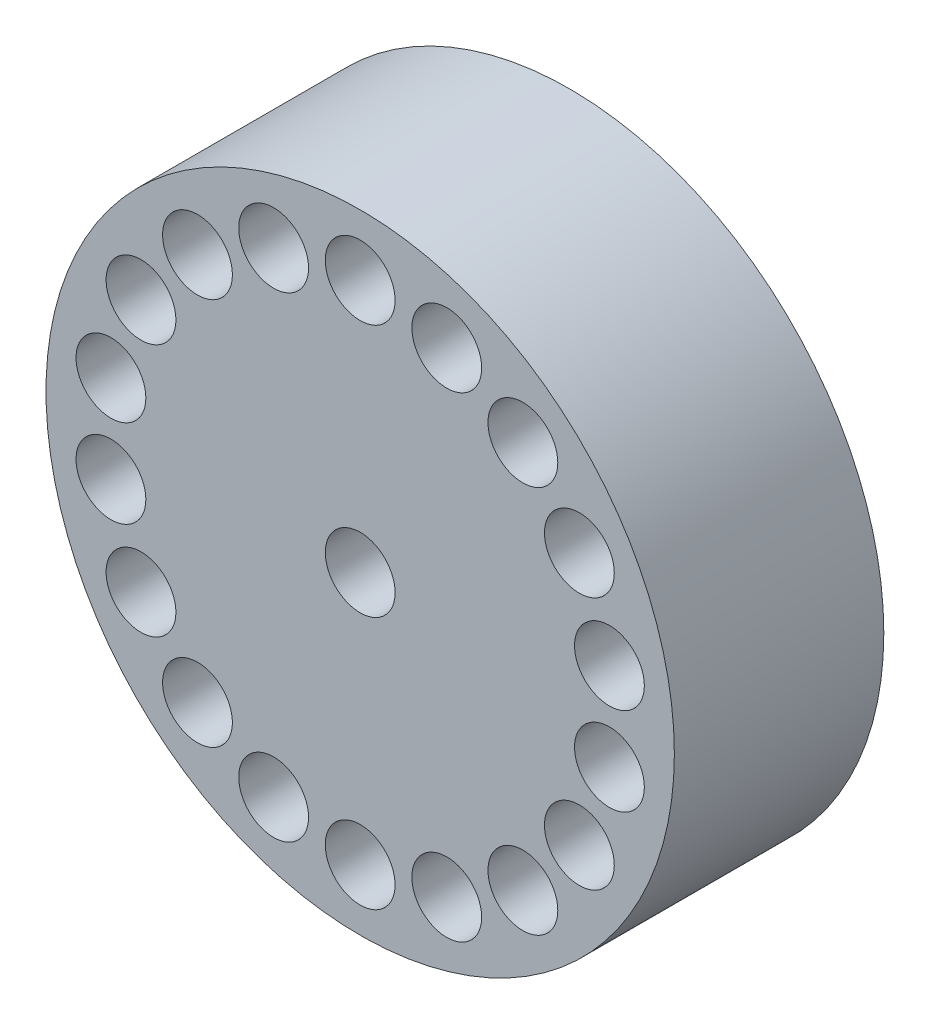
ISO-10303-21;
HEADER;
FILE_DESCRIPTION(('STEP AP214'),'2;1');
FILE_NAME('part.step','',(''),(''),'','','');
FILE_SCHEMA(('AUTOMOTIVE_DESIGN { 1 0 10303 214 1 1 1 1 }'));
ENDSEC;
DATA;
#1=APPLICATION_CONTEXT('core data for automotive mechanical design processes');
#2=APPLICATION_PROTOCOL_DEFINITION('international standard','automotive_design',2000,#1);
#3=PRODUCT_CONTEXT('',#1,'mechanical');
#4=PRODUCT('Part','Part','',(#3));
#5=PRODUCT_RELATED_PRODUCT_CATEGORY('part','',(#4));
#6=PRODUCT_DEFINITION_FORMATION('','',#4);
#7=PRODUCT_DEFINITION_CONTEXT('part definition',#1,'design');
#8=PRODUCT_DEFINITION('design','',#6,#7);
#9=PRODUCT_DEFINITION_SHAPE('','',#8);
#10=(LENGTH_UNIT() NAMED_UNIT(*) SI_UNIT(.MILLI.,.METRE.));
#11=(NAMED_UNIT(*) PLANE_ANGLE_UNIT() SI_UNIT($,.RADIAN.));
#12=(NAMED_UNIT(*) SI_UNIT($,.STERADIAN.) SOLID_ANGLE_UNIT());
#13=UNCERTAINTY_MEASURE_WITH_UNIT(LENGTH_MEASURE(1.E-05),#10,'distance_accuracy_value','');
#14=(GEOMETRIC_REPRESENTATION_CONTEXT(3) GLOBAL_UNCERTAINTY_ASSIGNED_CONTEXT((#13)) GLOBAL_UNIT_ASSIGNED_CONTEXT((#10,
#11,#12)) REPRESENTATION_CONTEXT('',''));
#15=CARTESIAN_POINT('',(0.,0.,0.));
#16=DIRECTION('',(0.,0.,1.));
#17=DIRECTION('',(1.,0.,0.));
#18=AXIS2_PLACEMENT_3D('',#15,#16,#17);
#19=CARTESIAN_POINT('',(0.,0.,3.));
#20=DIRECTION('',(0.,0.,1.));
#21=DIRECTION('',(1.,0.,0.));
#22=AXIS2_PLACEMENT_3D('',#19,#20,#21);
#23=PLANE('',#22);
#24=CARTESIAN_POINT('',(3.56992810466938,0.629474644042774,3.));
#25=DIRECTION('',(0.,0.,1.));
#26=DIRECTION('',(1.,0.,0.));
#27=AXIS2_PLACEMENT_3D('',#24,#25,#26);
#28=CIRCLE('',#27,0.500000000000088);
#29=CARTESIAN_POINT('',(4.06992810466947,0.629474644042774,3.));
#30=VERTEX_POINT('',#29);
#31=EDGE_CURVE('E119',#30,#30,#28,.T.);
#32=ORIENTED_EDGE('',*,*,#31,.F.);
#33=EDGE_LOOP('',(#32));
#34=FACE_BOUND('',#33,.T.);
#35=CARTESIAN_POINT('',(3.13934208871867,1.81250000000013,3.));
#36=DIRECTION('',(0.,0.,1.));
#37=DIRECTION('',(1.,0.,0.));
#38=AXIS2_PLACEMENT_3D('',#35,#36,#37);
#39=CIRCLE('',#38,0.500000000000043);
#40=CARTESIAN_POINT('',(3.63934208871871,1.81250000000013,3.));
#41=VERTEX_POINT('',#40);
#42=EDGE_CURVE('E147',#41,#41,#39,.T.);
#43=ORIENTED_EDGE('',*,*,#42,.F.);
#44=EDGE_LOOP('',(#43));
#45=FACE_BOUND('',#44,.T.);
#46=CARTESIAN_POINT('',(2.33010508511374,2.77691110630639,3.));
#47=DIRECTION('',(0.,0.,1.));
#48=DIRECTION('',(1.,0.,0.));
#49=AXIS2_PLACEMENT_3D('',#46,#47,#48);
#50=CIRCLE('',#49,0.500000000000011);
#51=CARTESIAN_POINT('',(2.83010508511375,2.77691110630639,3.));
#52=VERTEX_POINT('',#51);
#53=EDGE_CURVE('E130',#52,#52,#50,.T.);
#54=ORIENTED_EDGE('',*,*,#53,.F.);
#55=EDGE_LOOP('',(#54));
#56=FACE_BOUND('',#55,.T.);
#57=CARTESIAN_POINT('',(1.23982301955555,3.40638575034892,3.));
#58=DIRECTION('',(0.,0.,1.));
#59=DIRECTION('',(1.,0.,0.));
#60=AXIS2_PLACEMENT_3D('',#57,#58,#59);
#61=CIRCLE('',#60,0.5);
#62=CARTESIAN_POINT('',(1.73982301955555,3.40638575034892,3.));
#63=VERTEX_POINT('',#62);
#64=EDGE_CURVE('E137',#63,#63,#61,.T.);
#65=ORIENTED_EDGE('',*,*,#64,.F.);
#66=EDGE_LOOP('',(#65));
#67=FACE_BOUND('',#66,.T.);
#68=CARTESIAN_POINT('',(1.23982301955585,-3.40638575034887,3.));
#69=DIRECTION('',(0.,0.,1.));
#70=DIRECTION('',(1.,0.,0.));
#71=AXIS2_PLACEMENT_3D('',#68,#69,#70);
#72=CIRCLE('',#71,0.500000000000292);
#73=CARTESIAN_POINT('',(1.73982301955614,-3.40638575034887,3.));
#74=VERTEX_POINT('',#73);
#75=EDGE_CURVE('E105',#74,#74,#72,.T.);
#76=ORIENTED_EDGE('',*,*,#75,.F.);
#77=EDGE_LOOP('',(#76));
#78=FACE_BOUND('',#77,.T.);
#79=CARTESIAN_POINT('',(2.33010508511398,-2.7769111063062,3.));
#80=DIRECTION('',(0.,0.,1.));
#81=DIRECTION('',(1.,0.,0.));
#82=AXIS2_PLACEMENT_3D('',#79,#80,#81);
#83=CIRCLE('',#82,0.50000000000025);
#84=CARTESIAN_POINT('',(2.83010508511423,-2.7769111063062,3.));
#85=VERTEX_POINT('',#84);
#86=EDGE_CURVE('E125',#85,#85,#83,.T.);
#87=ORIENTED_EDGE('',*,*,#86,.F.);
#88=EDGE_LOOP('',(#87));
#89=FACE_BOUND('',#88,.T.);
#90=CARTESIAN_POINT('',(3.13934208871882,-1.81249999999987,3.));
#91=DIRECTION('',(0.,0.,1.));
#92=DIRECTION('',(1.,0.,0.));
#93=AXIS2_PLACEMENT_3D('',#90,#91,#92);
#94=CIRCLE('',#93,0.500000000000199);
#95=CARTESIAN_POINT('',(3.63934208871902,-1.81249999999987,3.));
#96=VERTEX_POINT('',#95);
#97=EDGE_CURVE('E106',#96,#96,#94,.T.);
#98=ORIENTED_EDGE('',*,*,#97,.F.);
#99=EDGE_LOOP('',(#98));
#100=FACE_BOUND('',#99,.T.);
#101=CARTESIAN_POINT('',(3.56992810466943,-0.629474644042471,3.));
#102=DIRECTION('',(0.,0.,1.));
#103=DIRECTION('',(1.,0.,0.));
#104=AXIS2_PLACEMENT_3D('',#101,#102,#103);
#105=CIRCLE('',#104,0.500000000000141);
#106=CARTESIAN_POINT('',(4.06992810466958,-0.629474644042471,3.));
#107=VERTEX_POINT('',#106);
#108=EDGE_CURVE('E113',#107,#107,#105,.T.);
#109=ORIENTED_EDGE('',*,*,#108,.F.);
#110=EDGE_LOOP('',(#109));
#111=FACE_BOUND('',#110,.T.);
#112=CARTESIAN_POINT('',(3.07754286661571E-13,-3.625,3.));
#113=DIRECTION('',(0.,0.,1.));
#114=DIRECTION('',(1.,0.,0.));
#115=AXIS2_PLACEMENT_3D('',#112,#113,#114);
#116=CIRCLE('',#115,0.500000000000319);
#117=CARTESIAN_POINT('',(0.500000000000626,-3.625,3.));
#118=VERTEX_POINT('',#117);
#119=EDGE_CURVE('E99',#118,#118,#116,.T.);
#120=ORIENTED_EDGE('',*,*,#119,.F.);
#121=EDGE_LOOP('',(#120));
#122=FACE_BOUND('',#121,.T.);
#123=CARTESIAN_POINT('',(-1.23982301955525,-3.40638575034897,3.));
#124=DIRECTION('',(0.,0.,1.));
#125=DIRECTION('',(1.,0.,0.));
#126=AXIS2_PLACEMENT_3D('',#123,#124,#125);
#127=CIRCLE('',#126,0.500000000000326);
#128=CARTESIAN_POINT('',(-0.739823019554925,-3.40638575034897,3.));
#129=VERTEX_POINT('',#128);
#130=EDGE_CURVE('E89',#129,#129,#127,.T.);
#131=ORIENTED_EDGE('',*,*,#130,.F.);
#132=EDGE_LOOP('',(#131));
#133=FACE_BOUND('',#132,.T.);
#134=CARTESIAN_POINT('',(-3.13934208871836,-1.81250000000013,3.));
#135=DIRECTION('',(0.,0.,1.));
#136=DIRECTION('',(1.,0.,0.));
#137=AXIS2_PLACEMENT_3D('',#134,#135,#136);
#138=CIRCLE('',#137,0.500000000000293);
#139=CARTESIAN_POINT('',(-2.63934208871807,-1.81250000000013,3.));
#140=VERTEX_POINT('',#139);
#141=EDGE_CURVE('E81',#140,#140,#138,.T.);
#142=ORIENTED_EDGE('',*,*,#141,.F.);
#143=EDGE_LOOP('',(#142));
#144=FACE_BOUND('',#143,.T.);
#145=CARTESIAN_POINT('',(-2.33010508511343,-2.77691110630639,3.));
#146=DIRECTION('',(0.,0.,1.));
#147=DIRECTION('',(1.,0.,0.));
#148=AXIS2_PLACEMENT_3D('',#145,#146,#147);
#149=CIRCLE('',#148,0.500000000000317);
#150=CARTESIAN_POINT('',(-1.83010508511312,-2.77691110630639,3.));
#151=VERTEX_POINT('',#150);
#152=EDGE_CURVE('E82',#151,#151,#149,.T.);
#153=ORIENTED_EDGE('',*,*,#152,.F.);
#154=EDGE_LOOP('',(#153));
#155=FACE_BOUND('',#154,.T.);
#156=CARTESIAN_POINT('',(-3.56992810466907,-0.629474644042774,3.));
#157=DIRECTION('',(0.,0.,1.));
#158=DIRECTION('',(1.,0.,0.));
#159=AXIS2_PLACEMENT_3D('',#156,#157,#158);
#160=CIRCLE('',#159,0.500000000000251);
#161=CARTESIAN_POINT('',(-3.06992810466882,-0.629474644042774,3.));
#162=VERTEX_POINT('',#161);
#163=EDGE_CURVE('E75',#162,#162,#160,.T.);
#164=ORIENTED_EDGE('',*,*,#163,.F.);
#165=EDGE_LOOP('',(#164));
#166=FACE_BOUND('',#165,.T.);
#167=CARTESIAN_POINT('',(-3.56992810466913,0.62947464404247,3.));
#168=DIRECTION('',(0.,0.,1.));
#169=DIRECTION('',(1.,0.,0.));
#170=AXIS2_PLACEMENT_3D('',#167,#168,#169);
#171=CIRCLE('',#170,0.500000000000202);
#172=CARTESIAN_POINT('',(-3.06992810466893,0.62947464404247,3.));
#173=VERTEX_POINT('',#172);
#174=EDGE_CURVE('E63',#173,#173,#171,.T.);
#175=ORIENTED_EDGE('',*,*,#174,.F.);
#176=EDGE_LOOP('',(#175));
#177=FACE_BOUND('',#176,.T.);
#178=CARTESIAN_POINT('',(-2.33010508511367,2.7769111063062,3.));
#179=DIRECTION('',(0.,0.,1.));
#180=DIRECTION('',(1.,0.,0.));
#181=AXIS2_PLACEMENT_3D('',#178,#179,#180);
#182=CIRCLE('',#181,0.500000000000108);
#183=CARTESIAN_POINT('',(-1.83010508511356,2.7769111063062,3.));
#184=VERTEX_POINT('',#183);
#185=EDGE_CURVE('E64',#184,#184,#182,.T.);
#186=ORIENTED_EDGE('',*,*,#185,.F.);
#187=EDGE_LOOP('',(#186));
#188=FACE_BOUND('',#187,.T.);
#189=CARTESIAN_POINT('',(-3.13934208871851,1.81249999999987,3.));
#190=DIRECTION('',(0.,0.,1.));
#191=DIRECTION('',(1.,0.,0.));
#192=AXIS2_PLACEMENT_3D('',#189,#190,#191);
#193=CIRCLE('',#192,0.500000000000153);
#194=CARTESIAN_POINT('',(-2.63934208871836,1.81249999999987,3.));
#195=VERTEX_POINT('',#194);
#196=EDGE_CURVE('E56',#195,#195,#193,.T.);
#197=ORIENTED_EDGE('',*,*,#196,.F.);
#198=EDGE_LOOP('',(#197));
#199=FACE_BOUND('',#198,.T.);
#200=CARTESIAN_POINT('',(-1.23982301955551,3.40638575034893,3.));
#201=DIRECTION('',(0.,0.,1.));
#202=DIRECTION('',(1.,0.,0.));
#203=AXIS2_PLACEMENT_3D('',#200,#201,#202);
#204=CIRCLE('',#203,0.5);
#205=CARTESIAN_POINT('',(-0.739823019555507,3.40638575034893,3.));
#206=VERTEX_POINT('',#205);
#207=EDGE_CURVE('E152',#206,#206,#204,.T.);
#208=ORIENTED_EDGE('',*,*,#207,.F.);
#209=EDGE_LOOP('',(#208));
#210=FACE_BOUND('',#209,.T.);
#211=CARTESIAN_POINT('',(0.,3.625,3.));
#212=DIRECTION('',(0.,0.,1.));
#213=DIRECTION('',(1.,0.,0.));
#214=AXIS2_PLACEMENT_3D('',#211,#212,#213);
#215=CIRCLE('',#214,0.5);
#216=CARTESIAN_POINT('',(0.5,3.625,3.));
#217=VERTEX_POINT('',#216);
#218=EDGE_CURVE('E50',#217,#217,#215,.T.);
#219=ORIENTED_EDGE('',*,*,#218,.F.);
#220=EDGE_LOOP('',(#219));
#221=FACE_BOUND('',#220,.T.);
#222=CARTESIAN_POINT('',(0.,0.,3.));
#223=DIRECTION('',(0.,0.,1.));
#224=DIRECTION('',(1.,0.,0.));
#225=AXIS2_PLACEMENT_3D('',#222,#223,#224);
#226=CIRCLE('',#225,4.5);
#227=CARTESIAN_POINT('',(4.5,0.,3.));
#228=VERTEX_POINT('',#227);
#229=EDGE_CURVE('E10',#228,#228,#226,.T.);
#230=ORIENTED_EDGE('',*,*,#229,.T.);
#231=EDGE_LOOP('',(#230));
#232=FACE_BOUND('',#231,.T.);
#233=CARTESIAN_POINT('',(0.,0.,3.));
#234=DIRECTION('',(0.,0.,1.));
#235=DIRECTION('',(1.,0.,0.));
#236=AXIS2_PLACEMENT_3D('',#233,#234,#235);
#237=CIRCLE('',#236,0.5);
#238=CARTESIAN_POINT('',(0.5,0.,3.));
#239=VERTEX_POINT('',#238);
#240=EDGE_CURVE('E42',#239,#239,#237,.T.);
#241=ORIENTED_EDGE('',*,*,#240,.F.);
#242=EDGE_LOOP('',(#241));
#243=FACE_BOUND('',#242,.T.);
#244=ADVANCED_FACE('F31',(#34,#45,#56,#67,#78,#89,#100,#111,#122,#133,#144,#155,#166,#177,#188,
#199,#210,#221,#232,#243),#23,.T.);
#245=CARTESIAN_POINT('',(0.,0.,0.));
#246=DIRECTION('',(0.,0.,1.));
#247=DIRECTION('',(1.,0.,0.));
#248=AXIS2_PLACEMENT_3D('',#245,#246,#247);
#249=PLANE('',#248);
#250=CARTESIAN_POINT('',(0.,0.,0.));
#251=DIRECTION('',(0.,0.,1.));
#252=DIRECTION('',(1.,0.,0.));
#253=AXIS2_PLACEMENT_3D('',#250,#251,#252);
#254=CIRCLE('',#253,4.5);
#255=CARTESIAN_POINT('',(4.5,0.,0.));
#256=VERTEX_POINT('',#255);
#257=EDGE_CURVE('E35',#256,#256,#254,.T.);
#258=ORIENTED_EDGE('',*,*,#257,.F.);
#259=EDGE_LOOP('',(#258));
#260=FACE_BOUND('',#259,.T.);
#261=CARTESIAN_POINT('',(0.,0.,0.));
#262=DIRECTION('',(0.,0.,1.));
#263=DIRECTION('',(1.,0.,0.));
#264=AXIS2_PLACEMENT_3D('',#261,#262,#263);
#265=CIRCLE('',#264,0.5);
#266=CARTESIAN_POINT('',(0.5,0.,0.));
#267=VERTEX_POINT('',#266);
#268=EDGE_CURVE('E44',#267,#267,#265,.T.);
#269=ORIENTED_EDGE('',*,*,#268,.T.);
#270=EDGE_LOOP('',(#269));
#271=FACE_BOUND('',#270,.T.);
#272=ADVANCED_FACE('F169',(#260,#271),#249,.F.);
#273=CARTESIAN_POINT('',(0.,0.,3.));
#274=DIRECTION('',(0.,0.,-1.));
#275=DIRECTION('',(-1.,0.,0.));
#276=AXIS2_PLACEMENT_3D('',#273,#274,#275);
#277=CYLINDRICAL_SURFACE('',#276,4.5);
#278=ORIENTED_EDGE('',*,*,#229,.F.);
#279=EDGE_LOOP('',(#278));
#280=FACE_BOUND('',#279,.T.);
#281=ORIENTED_EDGE('',*,*,#257,.T.);
#282=EDGE_LOOP('',(#281));
#283=FACE_BOUND('',#282,.T.);
#284=ADVANCED_FACE('F33',(#280,#283),#277,.T.);
#285=CARTESIAN_POINT('',(0.,0.,3.));
#286=DIRECTION('',(0.,0.,-1.));
#287=DIRECTION('',(-1.,0.,0.));
#288=AXIS2_PLACEMENT_3D('',#285,#286,#287);
#289=CYLINDRICAL_SURFACE('',#288,0.5);
#290=ORIENTED_EDGE('',*,*,#240,.T.);
#291=EDGE_LOOP('',(#290));
#292=FACE_BOUND('',#291,.T.);
#293=ORIENTED_EDGE('',*,*,#268,.F.);
#294=EDGE_LOOP('',(#293));
#295=FACE_BOUND('',#294,.T.);
#296=ADVANCED_FACE('F176',(#292,#295),#289,.F.);
#297=CARTESIAN_POINT('',(0.,3.625,2.));
#298=DIRECTION('',(0.,0.,1.));
#299=DIRECTION('',(1.,0.,0.));
#300=AXIS2_PLACEMENT_3D('',#297,#298,#299);
#301=CYLINDRICAL_SURFACE('',#300,0.5);
#302=CARTESIAN_POINT('',(0.,3.625,2.));
#303=DIRECTION('',(0.,0.,1.));
#304=DIRECTION('',(1.,0.,0.));
#305=AXIS2_PLACEMENT_3D('',#302,#303,#304);
#306=CIRCLE('',#305,0.5);
#307=CARTESIAN_POINT('',(0.5,3.625,2.));
#308=VERTEX_POINT('',#307);
#309=EDGE_CURVE('E47',#308,#308,#306,.T.);
#310=ORIENTED_EDGE('',*,*,#309,.F.);
#311=EDGE_LOOP('',(#310));
#312=FACE_BOUND('',#311,.T.);
#313=ORIENTED_EDGE('',*,*,#218,.T.);
#314=EDGE_LOOP('',(#313));
#315=FACE_BOUND('',#314,.T.);
#316=ADVANCED_FACE('F179',(#312,#315),#301,.F.);
#317=CARTESIAN_POINT('',(0.,3.625,2.));
#318=DIRECTION('',(0.,0.,1.));
#319=DIRECTION('',(1.,0.,0.));
#320=AXIS2_PLACEMENT_3D('',#317,#318,#319);
#321=PLANE('',#320);
#322=ORIENTED_EDGE('',*,*,#309,.T.);
#323=EDGE_LOOP('',(#322));
#324=FACE_BOUND('',#323,.T.);
#325=ADVANCED_FACE('F163',(#324),#321,.T.);
#326=CARTESIAN_POINT('',(-1.23982301955551,3.40638575034893,2.));
#327=DIRECTION('',(0.,0.,1.));
#328=DIRECTION('',(1.,0.,0.));
#329=AXIS2_PLACEMENT_3D('',#326,#327,#328);
#330=CYLINDRICAL_SURFACE('',#329,0.5);
#331=CARTESIAN_POINT('',(-1.23982301955551,3.40638575034893,2.));
#332=DIRECTION('',(0.,0.,1.));
#333=DIRECTION('',(1.,0.,0.));
#334=AXIS2_PLACEMENT_3D('',#331,#332,#333);
#335=CIRCLE('',#334,0.5);
#336=CARTESIAN_POINT('',(-0.739823019555507,3.40638575034893,2.));
#337=VERTEX_POINT('',#336);
#338=EDGE_CURVE('E67',#337,#337,#335,.T.);
#339=ORIENTED_EDGE('',*,*,#338,.F.);
#340=EDGE_LOOP('',(#339));
#341=FACE_BOUND('',#340,.T.);
#342=ORIENTED_EDGE('',*,*,#207,.T.);
#343=EDGE_LOOP('',(#342));
#344=FACE_BOUND('',#343,.T.);
#345=ADVANCED_FACE('F160',(#341,#344),#330,.F.);
#346=CARTESIAN_POINT('',(-1.23982301955551,3.40638575034893,2.));
#347=DIRECTION('',(0.,0.,1.));
#348=DIRECTION('',(1.,0.,0.));
#349=AXIS2_PLACEMENT_3D('',#346,#347,#348);
#350=PLANE('',#349);
#351=ORIENTED_EDGE('',*,*,#338,.T.);
#352=EDGE_LOOP('',(#351));
#353=FACE_BOUND('',#352,.T.);
#354=ADVANCED_FACE('F158',(#353),#350,.T.);
#355=CARTESIAN_POINT('',(-3.13934208871851,1.81249999999987,2.));
#356=DIRECTION('',(0.,0.,1.));
#357=DIRECTION('',(1.,0.,0.));
#358=AXIS2_PLACEMENT_3D('',#355,#356,#357);
#359=CYLINDRICAL_SURFACE('',#358,0.500000000000153);
#360=CARTESIAN_POINT('',(-3.13934208871851,1.81249999999987,2.));
#361=DIRECTION('',(0.,0.,1.));
#362=DIRECTION('',(1.,0.,0.));
#363=AXIS2_PLACEMENT_3D('',#360,#361,#362);
#364=CIRCLE('',#363,0.500000000000153);
#365=CARTESIAN_POINT('',(-2.63934208871836,1.81249999999987,2.));
#366=VERTEX_POINT('',#365);
#367=EDGE_CURVE('E59',#366,#366,#364,.T.);
#368=ORIENTED_EDGE('',*,*,#367,.F.);
#369=EDGE_LOOP('',(#368));
#370=FACE_BOUND('',#369,.T.);
#371=ORIENTED_EDGE('',*,*,#196,.T.);
#372=EDGE_LOOP('',(#371));
#373=FACE_BOUND('',#372,.T.);
#374=ADVANCED_FACE('F197',(#370,#373),#359,.F.);
#375=CARTESIAN_POINT('',(-3.13934208871851,1.81249999999987,2.));
#376=DIRECTION('',(0.,0.,1.));
#377=DIRECTION('',(1.,0.,0.));
#378=AXIS2_PLACEMENT_3D('',#375,#376,#377);
#379=PLANE('',#378);
#380=ORIENTED_EDGE('',*,*,#367,.T.);
#381=EDGE_LOOP('',(#380));
#382=FACE_BOUND('',#381,.T.);
#383=ADVANCED_FACE('F200',(#382),#379,.T.);
#384=CARTESIAN_POINT('',(-2.33010508511367,2.7769111063062,2.));
#385=DIRECTION('',(0.,0.,1.));
#386=DIRECTION('',(1.,0.,0.));
#387=AXIS2_PLACEMENT_3D('',#384,#385,#386);
#388=CYLINDRICAL_SURFACE('',#387,0.500000000000108);
#389=CARTESIAN_POINT('',(-2.33010508511367,2.7769111063062,2.));
#390=DIRECTION('',(0.,0.,1.));
#391=DIRECTION('',(1.,0.,0.));
#392=AXIS2_PLACEMENT_3D('',#389,#390,#391);
#393=CIRCLE('',#392,0.500000000000108);
#394=CARTESIAN_POINT('',(-1.83010508511356,2.7769111063062,2.));
#395=VERTEX_POINT('',#394);
#396=EDGE_CURVE('E60',#395,#395,#393,.T.);
#397=ORIENTED_EDGE('',*,*,#396,.F.);
#398=EDGE_LOOP('',(#397));
#399=FACE_BOUND('',#398,.T.);
#400=ORIENTED_EDGE('',*,*,#185,.T.);
#401=EDGE_LOOP('',(#400));
#402=FACE_BOUND('',#401,.T.);
#403=ADVANCED_FACE('F204',(#399,#402),#388,.F.);
#404=CARTESIAN_POINT('',(-2.33010508511367,2.7769111063062,2.));
#405=DIRECTION('',(0.,0.,1.));
#406=DIRECTION('',(1.,0.,0.));
#407=AXIS2_PLACEMENT_3D('',#404,#405,#406);
#408=PLANE('',#407);
#409=ORIENTED_EDGE('',*,*,#396,.T.);
#410=EDGE_LOOP('',(#409));
#411=FACE_BOUND('',#410,.T.);
#412=ADVANCED_FACE('F208',(#411),#408,.T.);
#413=CARTESIAN_POINT('',(-3.56992810466913,0.62947464404247,2.));
#414=DIRECTION('',(0.,0.,1.));
#415=DIRECTION('',(1.,0.,0.));
#416=AXIS2_PLACEMENT_3D('',#413,#414,#415);
#417=CYLINDRICAL_SURFACE('',#416,0.500000000000202);
#418=CARTESIAN_POINT('',(-3.56992810466913,0.62947464404247,2.));
#419=DIRECTION('',(0.,0.,1.));
#420=DIRECTION('',(1.,0.,0.));
#421=AXIS2_PLACEMENT_3D('',#418,#419,#420);
#422=CIRCLE('',#421,0.500000000000202);
#423=CARTESIAN_POINT('',(-3.06992810466893,0.62947464404247,2.));
#424=VERTEX_POINT('',#423);
#425=EDGE_CURVE('E72',#424,#424,#422,.T.);
#426=ORIENTED_EDGE('',*,*,#425,.F.);
#427=EDGE_LOOP('',(#426));
#428=FACE_BOUND('',#427,.T.);
#429=ORIENTED_EDGE('',*,*,#174,.T.);
#430=EDGE_LOOP('',(#429));
#431=FACE_BOUND('',#430,.T.);
#432=ADVANCED_FACE('F212',(#428,#431),#417,.F.);
#433=CARTESIAN_POINT('',(-3.56992810466913,0.62947464404247,2.));
#434=DIRECTION('',(0.,0.,1.));
#435=DIRECTION('',(1.,0.,0.));
#436=AXIS2_PLACEMENT_3D('',#433,#434,#435);
#437=PLANE('',#436);
#438=ORIENTED_EDGE('',*,*,#425,.T.);
#439=EDGE_LOOP('',(#438));
#440=FACE_BOUND('',#439,.T.);
#441=ADVANCED_FACE('F216',(#440),#437,.T.);
#442=CARTESIAN_POINT('',(-3.56992810466907,-0.629474644042774,2.));
#443=DIRECTION('',(0.,0.,1.));
#444=DIRECTION('',(1.,0.,0.));
#445=AXIS2_PLACEMENT_3D('',#442,#443,#444);
#446=CYLINDRICAL_SURFACE('',#445,0.500000000000251);
#447=CARTESIAN_POINT('',(-3.56992810466907,-0.629474644042774,2.));
#448=DIRECTION('',(0.,0.,1.));
#449=DIRECTION('',(1.,0.,0.));
#450=AXIS2_PLACEMENT_3D('',#447,#448,#449);
#451=CIRCLE('',#450,0.500000000000251);
#452=CARTESIAN_POINT('',(-3.06992810466882,-0.629474644042774,2.));
#453=VERTEX_POINT('',#452);
#454=EDGE_CURVE('E78',#453,#453,#451,.T.);
#455=ORIENTED_EDGE('',*,*,#454,.F.);
#456=EDGE_LOOP('',(#455));
#457=FACE_BOUND('',#456,.T.);
#458=ORIENTED_EDGE('',*,*,#163,.T.);
#459=EDGE_LOOP('',(#458));
#460=FACE_BOUND('',#459,.T.);
#461=ADVANCED_FACE('F220',(#457,#460),#446,.F.);
#462=CARTESIAN_POINT('',(-3.56992810466907,-0.629474644042774,2.));
#463=DIRECTION('',(0.,0.,1.));
#464=DIRECTION('',(1.,0.,0.));
#465=AXIS2_PLACEMENT_3D('',#462,#463,#464);
#466=PLANE('',#465);
#467=ORIENTED_EDGE('',*,*,#454,.T.);
#468=EDGE_LOOP('',(#467));
#469=FACE_BOUND('',#468,.T.);
#470=ADVANCED_FACE('F224',(#469),#466,.T.);
#471=CARTESIAN_POINT('',(-2.33010508511343,-2.77691110630639,2.));
#472=DIRECTION('',(0.,0.,1.));
#473=DIRECTION('',(1.,0.,0.));
#474=AXIS2_PLACEMENT_3D('',#471,#472,#473);
#475=CYLINDRICAL_SURFACE('',#474,0.500000000000317);
#476=CARTESIAN_POINT('',(-2.33010508511343,-2.77691110630639,2.));
#477=DIRECTION('',(0.,0.,1.));
#478=DIRECTION('',(1.,0.,0.));
#479=AXIS2_PLACEMENT_3D('',#476,#477,#478);
#480=CIRCLE('',#479,0.500000000000317);
#481=CARTESIAN_POINT('',(-1.83010508511312,-2.77691110630639,2.));
#482=VERTEX_POINT('',#481);
#483=EDGE_CURVE('E85',#482,#482,#480,.T.);
#484=ORIENTED_EDGE('',*,*,#483,.F.);
#485=EDGE_LOOP('',(#484));
#486=FACE_BOUND('',#485,.T.);
#487=ORIENTED_EDGE('',*,*,#152,.T.);
#488=EDGE_LOOP('',(#487));
#489=FACE_BOUND('',#488,.T.);
#490=ADVANCED_FACE('F228',(#486,#489),#475,.F.);
#491=CARTESIAN_POINT('',(-2.33010508511343,-2.77691110630639,2.));
#492=DIRECTION('',(0.,0.,1.));
#493=DIRECTION('',(1.,0.,0.));
#494=AXIS2_PLACEMENT_3D('',#491,#492,#493);
#495=PLANE('',#494);
#496=ORIENTED_EDGE('',*,*,#483,.T.);
#497=EDGE_LOOP('',(#496));
#498=FACE_BOUND('',#497,.T.);
#499=ADVANCED_FACE('F232',(#498),#495,.T.);
#500=CARTESIAN_POINT('',(-3.13934208871836,-1.81250000000013,2.));
#501=DIRECTION('',(0.,0.,1.));
#502=DIRECTION('',(1.,0.,0.));
#503=AXIS2_PLACEMENT_3D('',#500,#501,#502);
#504=CYLINDRICAL_SURFACE('',#503,0.500000000000293);
#505=CARTESIAN_POINT('',(-3.13934208871836,-1.81250000000013,2.));
#506=DIRECTION('',(0.,0.,1.));
#507=DIRECTION('',(1.,0.,0.));
#508=AXIS2_PLACEMENT_3D('',#505,#506,#507);
#509=CIRCLE('',#508,0.500000000000293);
#510=CARTESIAN_POINT('',(-2.63934208871807,-1.81250000000013,2.));
#511=VERTEX_POINT('',#510);
#512=EDGE_CURVE('E86',#511,#511,#509,.T.);
#513=ORIENTED_EDGE('',*,*,#512,.F.);
#514=EDGE_LOOP('',(#513));
#515=FACE_BOUND('',#514,.T.);
#516=ORIENTED_EDGE('',*,*,#141,.T.);
#517=EDGE_LOOP('',(#516));
#518=FACE_BOUND('',#517,.T.);
#519=ADVANCED_FACE('F236',(#515,#518),#504,.F.);
#520=CARTESIAN_POINT('',(-3.13934208871836,-1.81250000000013,2.));
#521=DIRECTION('',(0.,0.,1.));
#522=DIRECTION('',(1.,0.,0.));
#523=AXIS2_PLACEMENT_3D('',#520,#521,#522);
#524=PLANE('',#523);
#525=ORIENTED_EDGE('',*,*,#512,.T.);
#526=EDGE_LOOP('',(#525));
#527=FACE_BOUND('',#526,.T.);
#528=ADVANCED_FACE('F240',(#527),#524,.T.);
#529=CARTESIAN_POINT('',(-1.23982301955525,-3.40638575034897,2.));
#530=DIRECTION('',(0.,0.,1.));
#531=DIRECTION('',(1.,0.,0.));
#532=AXIS2_PLACEMENT_3D('',#529,#530,#531);
#533=CYLINDRICAL_SURFACE('',#532,0.500000000000326);
#534=CARTESIAN_POINT('',(-1.23982301955525,-3.40638575034897,2.));
#535=DIRECTION('',(0.,0.,1.));
#536=DIRECTION('',(1.,0.,0.));
#537=AXIS2_PLACEMENT_3D('',#534,#535,#536);
#538=CIRCLE('',#537,0.500000000000326);
#539=CARTESIAN_POINT('',(-0.739823019554925,-3.40638575034897,2.));
#540=VERTEX_POINT('',#539);
#541=EDGE_CURVE('E96',#540,#540,#538,.T.);
#542=ORIENTED_EDGE('',*,*,#541,.F.);
#543=EDGE_LOOP('',(#542));
#544=FACE_BOUND('',#543,.T.);
#545=ORIENTED_EDGE('',*,*,#130,.T.);
#546=EDGE_LOOP('',(#545));
#547=FACE_BOUND('',#546,.T.);
#548=ADVANCED_FACE('F244',(#544,#547),#533,.F.);
#549=CARTESIAN_POINT('',(-1.23982301955525,-3.40638575034897,2.));
#550=DIRECTION('',(0.,0.,1.));
#551=DIRECTION('',(1.,0.,0.));
#552=AXIS2_PLACEMENT_3D('',#549,#550,#551);
#553=PLANE('',#552);
#554=ORIENTED_EDGE('',*,*,#541,.T.);
#555=EDGE_LOOP('',(#554));
#556=FACE_BOUND('',#555,.T.);
#557=ADVANCED_FACE('F248',(#556),#553,.T.);
#558=CARTESIAN_POINT('',(3.07754286661571E-13,-3.625,2.));
#559=DIRECTION('',(0.,0.,1.));
#560=DIRECTION('',(1.,0.,0.));
#561=AXIS2_PLACEMENT_3D('',#558,#559,#560);
#562=CYLINDRICAL_SURFACE('',#561,0.500000000000319);
#563=CARTESIAN_POINT('',(3.07754286661571E-13,-3.625,2.));
#564=DIRECTION('',(0.,0.,1.));
#565=DIRECTION('',(1.,0.,0.));
#566=AXIS2_PLACEMENT_3D('',#563,#564,#565);
#567=CIRCLE('',#566,0.500000000000319);
#568=CARTESIAN_POINT('',(0.500000000000626,-3.625,2.));
#569=VERTEX_POINT('',#568);
#570=EDGE_CURVE('E102',#569,#569,#567,.T.);
#571=ORIENTED_EDGE('',*,*,#570,.F.);
#572=EDGE_LOOP('',(#571));
#573=FACE_BOUND('',#572,.T.);
#574=ORIENTED_EDGE('',*,*,#119,.T.);
#575=EDGE_LOOP('',(#574));
#576=FACE_BOUND('',#575,.T.);
#577=ADVANCED_FACE('F252',(#573,#576),#562,.F.);
#578=CARTESIAN_POINT('',(3.07754286661571E-13,-3.625,2.));
#579=DIRECTION('',(0.,0.,1.));
#580=DIRECTION('',(1.,0.,0.));
#581=AXIS2_PLACEMENT_3D('',#578,#579,#580);
#582=PLANE('',#581);
#583=ORIENTED_EDGE('',*,*,#570,.T.);
#584=EDGE_LOOP('',(#583));
#585=FACE_BOUND('',#584,.T.);
#586=ADVANCED_FACE('F256',(#585),#582,.T.);
#587=CARTESIAN_POINT('',(3.56992810466943,-0.629474644042471,2.));
#588=DIRECTION('',(0.,0.,1.));
#589=DIRECTION('',(1.,0.,0.));
#590=AXIS2_PLACEMENT_3D('',#587,#588,#589);
#591=CYLINDRICAL_SURFACE('',#590,0.500000000000141);
#592=CARTESIAN_POINT('',(3.56992810466943,-0.629474644042471,2.));
#593=DIRECTION('',(0.,0.,1.));
#594=DIRECTION('',(1.,0.,0.));
#595=AXIS2_PLACEMENT_3D('',#592,#593,#594);
#596=CIRCLE('',#595,0.500000000000141);
#597=CARTESIAN_POINT('',(4.06992810466958,-0.629474644042471,2.));
#598=VERTEX_POINT('',#597);
#599=EDGE_CURVE('E116',#598,#598,#596,.T.);
#600=ORIENTED_EDGE('',*,*,#599,.F.);
#601=EDGE_LOOP('',(#600));
#602=FACE_BOUND('',#601,.T.);
#603=ORIENTED_EDGE('',*,*,#108,.T.);
#604=EDGE_LOOP('',(#603));
#605=FACE_BOUND('',#604,.T.);
#606=ADVANCED_FACE('F260',(#602,#605),#591,.F.);
#607=CARTESIAN_POINT('',(3.56992810466943,-0.629474644042471,2.));
#608=DIRECTION('',(0.,0.,1.));
#609=DIRECTION('',(1.,0.,0.));
#610=AXIS2_PLACEMENT_3D('',#607,#608,#609);
#611=PLANE('',#610);
#612=ORIENTED_EDGE('',*,*,#599,.T.);
#613=EDGE_LOOP('',(#612));
#614=FACE_BOUND('',#613,.T.);
#615=ADVANCED_FACE('F266',(#614),#611,.T.);
#616=CARTESIAN_POINT('',(3.13934208871882,-1.81249999999987,2.));
#617=DIRECTION('',(0.,0.,1.));
#618=DIRECTION('',(1.,0.,0.));
#619=AXIS2_PLACEMENT_3D('',#616,#617,#618);
#620=CYLINDRICAL_SURFACE('',#619,0.500000000000199);
#621=CARTESIAN_POINT('',(3.13934208871882,-1.81249999999987,2.));
#622=DIRECTION('',(0.,0.,1.));
#623=DIRECTION('',(1.,0.,0.));
#624=AXIS2_PLACEMENT_3D('',#621,#622,#623);
#625=CIRCLE('',#624,0.500000000000199);
#626=CARTESIAN_POINT('',(3.63934208871902,-1.81249999999987,2.));
#627=VERTEX_POINT('',#626);
#628=EDGE_CURVE('E109',#627,#627,#625,.T.);
#629=ORIENTED_EDGE('',*,*,#628,.F.);
#630=EDGE_LOOP('',(#629));
#631=FACE_BOUND('',#630,.T.);
#632=ORIENTED_EDGE('',*,*,#97,.T.);
#633=EDGE_LOOP('',(#632));
#634=FACE_BOUND('',#633,.T.);
#635=ADVANCED_FACE('F262',(#631,#634),#620,.F.);
#636=CARTESIAN_POINT('',(3.13934208871882,-1.81249999999987,2.));
#637=DIRECTION('',(0.,0.,1.));
#638=DIRECTION('',(1.,0.,0.));
#639=AXIS2_PLACEMENT_3D('',#636,#637,#638);
#640=PLANE('',#639);
#641=ORIENTED_EDGE('',*,*,#628,.T.);
#642=EDGE_LOOP('',(#641));
#643=FACE_BOUND('',#642,.T.);
#644=ADVANCED_FACE('F265',(#643),#640,.T.);
#645=CARTESIAN_POINT('',(2.33010508511398,-2.7769111063062,2.));
#646=DIRECTION('',(0.,0.,1.));
#647=DIRECTION('',(1.,0.,0.));
#648=AXIS2_PLACEMENT_3D('',#645,#646,#647);
#649=CYLINDRICAL_SURFACE('',#648,0.50000000000025);
#650=CARTESIAN_POINT('',(2.33010508511398,-2.7769111063062,2.));
#651=DIRECTION('',(0.,0.,1.));
#652=DIRECTION('',(1.,0.,0.));
#653=AXIS2_PLACEMENT_3D('',#650,#651,#652);
#654=CIRCLE('',#653,0.50000000000025);
#655=CARTESIAN_POINT('',(2.83010508511423,-2.7769111063062,2.));
#656=VERTEX_POINT('',#655);
#657=EDGE_CURVE('E110',#656,#656,#654,.T.);
#658=ORIENTED_EDGE('',*,*,#657,.F.);
#659=EDGE_LOOP('',(#658));
#660=FACE_BOUND('',#659,.T.);
#661=ORIENTED_EDGE('',*,*,#86,.T.);
#662=EDGE_LOOP('',(#661));
#663=FACE_BOUND('',#662,.T.);
#664=ADVANCED_FACE('F270',(#660,#663),#649,.F.);
#665=CARTESIAN_POINT('',(2.33010508511398,-2.7769111063062,2.));
#666=DIRECTION('',(0.,0.,1.));
#667=DIRECTION('',(1.,0.,0.));
#668=AXIS2_PLACEMENT_3D('',#665,#666,#667);
#669=PLANE('',#668);
#670=ORIENTED_EDGE('',*,*,#657,.T.);
#671=EDGE_LOOP('',(#670));
#672=FACE_BOUND('',#671,.T.);
#673=ADVANCED_FACE('F282',(#672),#669,.T.);
#674=CARTESIAN_POINT('',(1.23982301955585,-3.40638575034887,2.));
#675=DIRECTION('',(0.,0.,1.));
#676=DIRECTION('',(1.,0.,0.));
#677=AXIS2_PLACEMENT_3D('',#674,#675,#676);
#678=CYLINDRICAL_SURFACE('',#677,0.500000000000292);
#679=CARTESIAN_POINT('',(1.23982301955585,-3.40638575034887,2.));
#680=DIRECTION('',(0.,0.,1.));
#681=DIRECTION('',(1.,0.,0.));
#682=AXIS2_PLACEMENT_3D('',#679,#680,#681);
#683=CIRCLE('',#682,0.500000000000292);
#684=CARTESIAN_POINT('',(1.73982301955614,-3.40638575034887,2.));
#685=VERTEX_POINT('',#684);
#686=EDGE_CURVE('E122',#685,#685,#683,.T.);
#687=ORIENTED_EDGE('',*,*,#686,.F.);
#688=EDGE_LOOP('',(#687));
#689=FACE_BOUND('',#688,.T.);
#690=ORIENTED_EDGE('',*,*,#75,.T.);
#691=EDGE_LOOP('',(#690));
#692=FACE_BOUND('',#691,.T.);
#693=ADVANCED_FACE('F278',(#689,#692),#678,.F.);
#694=CARTESIAN_POINT('',(1.23982301955585,-3.40638575034887,2.));
#695=DIRECTION('',(0.,0.,1.));
#696=DIRECTION('',(1.,0.,0.));
#697=AXIS2_PLACEMENT_3D('',#694,#695,#696);
#698=PLANE('',#697);
#699=ORIENTED_EDGE('',*,*,#686,.T.);
#700=EDGE_LOOP('',(#699));
#701=FACE_BOUND('',#700,.T.);
#702=ADVANCED_FACE('F281',(#701),#698,.T.);
#703=CARTESIAN_POINT('',(1.23982301955555,3.40638575034892,2.));
#704=DIRECTION('',(0.,0.,1.));
#705=DIRECTION('',(1.,0.,0.));
#706=AXIS2_PLACEMENT_3D('',#703,#704,#705);
#707=CYLINDRICAL_SURFACE('',#706,0.5);
#708=CARTESIAN_POINT('',(1.23982301955555,3.40638575034892,2.));
#709=DIRECTION('',(0.,0.,1.));
#710=DIRECTION('',(1.,0.,0.));
#711=AXIS2_PLACEMENT_3D('',#708,#709,#710);
#712=CIRCLE('',#711,0.5);
#713=CARTESIAN_POINT('',(1.73982301955555,3.40638575034892,2.));
#714=VERTEX_POINT('',#713);
#715=EDGE_CURVE('E53',#714,#714,#712,.T.);
#716=ORIENTED_EDGE('',*,*,#715,.F.);
#717=EDGE_LOOP('',(#716));
#718=FACE_BOUND('',#717,.T.);
#719=ORIENTED_EDGE('',*,*,#64,.T.);
#720=EDGE_LOOP('',(#719));
#721=FACE_BOUND('',#720,.T.);
#722=ADVANCED_FACE('F286',(#718,#721),#707,.F.);
#723=CARTESIAN_POINT('',(1.23982301955555,3.40638575034892,2.));
#724=DIRECTION('',(0.,0.,1.));
#725=DIRECTION('',(1.,0.,0.));
#726=AXIS2_PLACEMENT_3D('',#723,#724,#725);
#727=PLANE('',#726);
#728=ORIENTED_EDGE('',*,*,#715,.T.);
#729=EDGE_LOOP('',(#728));
#730=FACE_BOUND('',#729,.T.);
#731=ADVANCED_FACE('F298',(#730),#727,.T.);
#732=CARTESIAN_POINT('',(2.33010508511374,2.77691110630639,2.));
#733=DIRECTION('',(0.,0.,1.));
#734=DIRECTION('',(1.,0.,0.));
#735=AXIS2_PLACEMENT_3D('',#732,#733,#734);
#736=CYLINDRICAL_SURFACE('',#735,0.500000000000011);
#737=CARTESIAN_POINT('',(2.33010508511374,2.77691110630639,2.));
#738=DIRECTION('',(0.,0.,1.));
#739=DIRECTION('',(1.,0.,0.));
#740=AXIS2_PLACEMENT_3D('',#737,#738,#739);
#741=CIRCLE('',#740,0.500000000000011);
#742=CARTESIAN_POINT('',(2.83010508511375,2.77691110630639,2.));
#743=VERTEX_POINT('',#742);
#744=EDGE_CURVE('E133',#743,#743,#741,.T.);
#745=ORIENTED_EDGE('',*,*,#744,.F.);
#746=EDGE_LOOP('',(#745));
#747=FACE_BOUND('',#746,.T.);
#748=ORIENTED_EDGE('',*,*,#53,.T.);
#749=EDGE_LOOP('',(#748));
#750=FACE_BOUND('',#749,.T.);
#751=ADVANCED_FACE('F294',(#747,#750),#736,.F.);
#752=CARTESIAN_POINT('',(2.33010508511374,2.77691110630639,2.));
#753=DIRECTION('',(0.,0.,1.));
#754=DIRECTION('',(1.,0.,0.));
#755=AXIS2_PLACEMENT_3D('',#752,#753,#754);
#756=PLANE('',#755);
#757=ORIENTED_EDGE('',*,*,#744,.T.);
#758=EDGE_LOOP('',(#757));
#759=FACE_BOUND('',#758,.T.);
#760=ADVANCED_FACE('F297',(#759),#756,.T.);
#761=CARTESIAN_POINT('',(3.13934208871867,1.81250000000013,2.));
#762=DIRECTION('',(0.,0.,1.));
#763=DIRECTION('',(1.,0.,0.));
#764=AXIS2_PLACEMENT_3D('',#761,#762,#763);
#765=CYLINDRICAL_SURFACE('',#764,0.500000000000043);
#766=CARTESIAN_POINT('',(3.13934208871867,1.81250000000013,2.));
#767=DIRECTION('',(0.,0.,1.));
#768=DIRECTION('',(1.,0.,0.));
#769=AXIS2_PLACEMENT_3D('',#766,#767,#768);
#770=CIRCLE('',#769,0.500000000000043);
#771=CARTESIAN_POINT('',(3.63934208871871,1.81250000000013,2.));
#772=VERTEX_POINT('',#771);
#773=EDGE_CURVE('E134',#772,#772,#770,.T.);
#774=ORIENTED_EDGE('',*,*,#773,.F.);
#775=EDGE_LOOP('',(#774));
#776=FACE_BOUND('',#775,.T.);
#777=ORIENTED_EDGE('',*,*,#42,.T.);
#778=EDGE_LOOP('',(#777));
#779=FACE_BOUND('',#778,.T.);
#780=ADVANCED_FACE('F302',(#776,#779),#765,.F.);
#781=CARTESIAN_POINT('',(3.13934208871867,1.81250000000013,2.));
#782=DIRECTION('',(0.,0.,1.));
#783=DIRECTION('',(1.,0.,0.));
#784=AXIS2_PLACEMENT_3D('',#781,#782,#783);
#785=PLANE('',#784);
#786=ORIENTED_EDGE('',*,*,#773,.T.);
#787=EDGE_LOOP('',(#786));
#788=FACE_BOUND('',#787,.T.);
#789=ADVANCED_FACE('F314',(#788),#785,.T.);
#790=CARTESIAN_POINT('',(3.56992810466938,0.629474644042774,2.));
#791=DIRECTION('',(0.,0.,1.));
#792=DIRECTION('',(1.,0.,0.));
#793=AXIS2_PLACEMENT_3D('',#790,#791,#792);
#794=CYLINDRICAL_SURFACE('',#793,0.500000000000088);
#795=CARTESIAN_POINT('',(3.56992810466938,0.629474644042774,2.));
#796=DIRECTION('',(0.,0.,1.));
#797=DIRECTION('',(1.,0.,0.));
#798=AXIS2_PLACEMENT_3D('',#795,#796,#797);
#799=CIRCLE('',#798,0.500000000000088);
#800=CARTESIAN_POINT('',(4.06992810466947,0.629474644042774,2.));
#801=VERTEX_POINT('',#800);
#802=EDGE_CURVE('E144',#801,#801,#799,.T.);
#803=ORIENTED_EDGE('',*,*,#802,.F.);
#804=EDGE_LOOP('',(#803));
#805=FACE_BOUND('',#804,.T.);
#806=ORIENTED_EDGE('',*,*,#31,.T.);
#807=EDGE_LOOP('',(#806));
#808=FACE_BOUND('',#807,.T.);
#809=ADVANCED_FACE('F310',(#805,#808),#794,.F.);
#810=CARTESIAN_POINT('',(3.56992810466938,0.629474644042774,2.));
#811=DIRECTION('',(0.,0.,1.));
#812=DIRECTION('',(1.,0.,0.));
#813=AXIS2_PLACEMENT_3D('',#810,#811,#812);
#814=PLANE('',#813);
#815=ORIENTED_EDGE('',*,*,#802,.T.);
#816=EDGE_LOOP('',(#815));
#817=FACE_BOUND('',#816,.T.);
#818=ADVANCED_FACE('F313',(#817),#814,.T.);
#819=CLOSED_SHELL('',(#244,#272,#284,#296,#316,#325,#345,#354,#374,#383,#403,#412,#432,#441,
#461,#470,#490,#499,#519,#528,#548,#557,#577,#586,#606,#615,#635,#644,#664,#673,#693,#702,#722,
#731,#751,#760,#780,#789,#809,#818));
#820=MANIFOLD_SOLID_BREP('B2',#819);
#821=ADVANCED_BREP_SHAPE_REPRESENTATION('',(#18,#820),#14);
#822=SHAPE_DEFINITION_REPRESENTATION(#9,#821);
ENDSEC;
END-ISO-10303-21;
